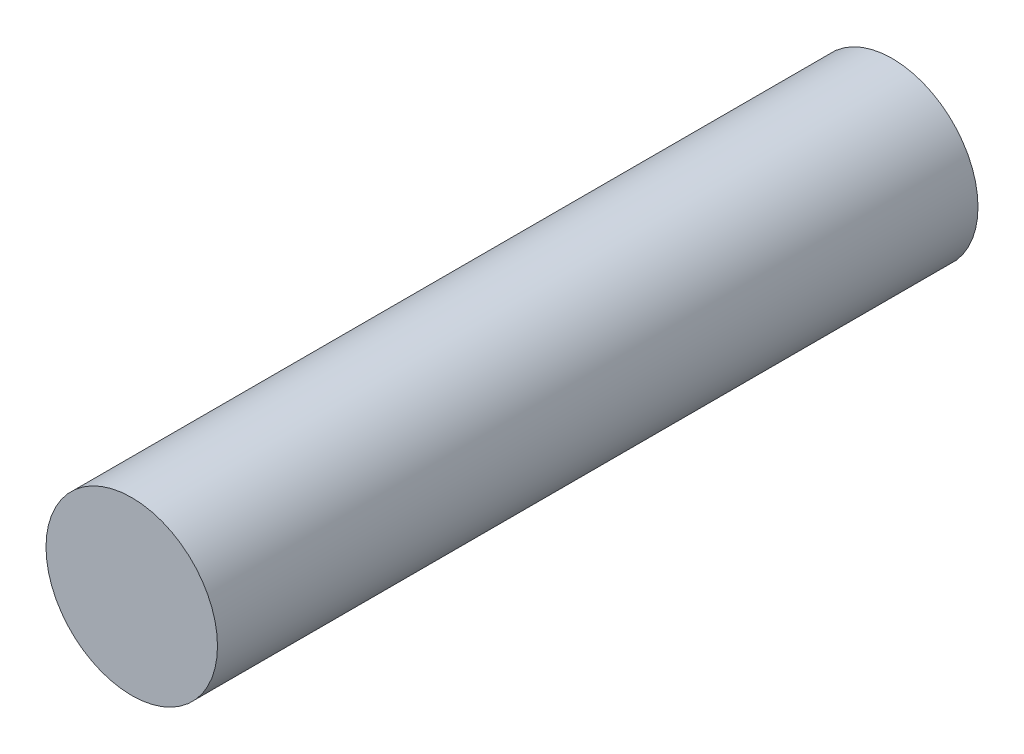
ISO-10303-21;
HEADER;
FILE_DESCRIPTION(('STEP AP214'),'2;1');
FILE_NAME('part.step','',(''),(''),'','','');
FILE_SCHEMA(('AUTOMOTIVE_DESIGN { 1 0 10303 214 1 1 1 1 }'));
ENDSEC;
DATA;
#1=APPLICATION_CONTEXT('core data for automotive mechanical design processes');
#2=APPLICATION_PROTOCOL_DEFINITION('international standard','automotive_design',2000,#1);
#3=PRODUCT_CONTEXT('',#1,'mechanical');
#4=PRODUCT('Part','Part','',(#3));
#5=PRODUCT_RELATED_PRODUCT_CATEGORY('part','',(#4));
#6=PRODUCT_DEFINITION_FORMATION('','',#4);
#7=PRODUCT_DEFINITION_CONTEXT('part definition',#1,'design');
#8=PRODUCT_DEFINITION('design','',#6,#7);
#9=PRODUCT_DEFINITION_SHAPE('','',#8);
#10=(LENGTH_UNIT() NAMED_UNIT(*) SI_UNIT(.MILLI.,.METRE.));
#11=(NAMED_UNIT(*) PLANE_ANGLE_UNIT() SI_UNIT($,.RADIAN.));
#12=(NAMED_UNIT(*) SI_UNIT($,.STERADIAN.) SOLID_ANGLE_UNIT());
#13=UNCERTAINTY_MEASURE_WITH_UNIT(LENGTH_MEASURE(1.E-05),#10,'distance_accuracy_value','');
#14=(GEOMETRIC_REPRESENTATION_CONTEXT(3) GLOBAL_UNCERTAINTY_ASSIGNED_CONTEXT((#13)) GLOBAL_UNIT_ASSIGNED_CONTEXT((#10,
#11,#12)) REPRESENTATION_CONTEXT('',''));
#15=CARTESIAN_POINT('',(0.,0.,0.));
#16=DIRECTION('',(0.,0.,1.));
#17=DIRECTION('',(1.,0.,0.));
#18=AXIS2_PLACEMENT_3D('',#15,#16,#17);
#19=CARTESIAN_POINT('',(0.,0.,-80.));
#20=DIRECTION('',(0.,0.,1.));
#21=DIRECTION('',(1.,0.,0.));
#22=AXIS2_PLACEMENT_3D('',#19,#20,#21);
#23=CYLINDRICAL_SURFACE('',#22,9.01950000000085);
#24=CARTESIAN_POINT('',(0.,0.,-80.));
#25=DIRECTION('',(0.,0.,1.));
#26=DIRECTION('',(1.,0.,0.));
#27=AXIS2_PLACEMENT_3D('',#24,#25,#26);
#28=CIRCLE('',#27,9.01950000000085);
#29=CARTESIAN_POINT('',(9.01950000000085,0.,-80.));
#30=VERTEX_POINT('',#29);
#31=EDGE_CURVE('E10',#30,#30,#28,.T.);
#32=ORIENTED_EDGE('',*,*,#31,.T.);
#33=EDGE_LOOP('',(#32));
#34=FACE_BOUND('',#33,.T.);
#35=CARTESIAN_POINT('',(0.,0.,0.));
#36=DIRECTION('',(0.,0.,1.));
#37=DIRECTION('',(1.,0.,0.));
#38=AXIS2_PLACEMENT_3D('',#35,#36,#37);
#39=CIRCLE('',#38,9.01950000000085);
#40=CARTESIAN_POINT('',(9.01950000000085,0.,0.));
#41=VERTEX_POINT('',#40);
#42=EDGE_CURVE('E33',#41,#41,#39,.T.);
#43=ORIENTED_EDGE('',*,*,#42,.F.);
#44=EDGE_LOOP('',(#43));
#45=FACE_BOUND('',#44,.T.);
#46=ADVANCED_FACE('F30',(#34,#45),#23,.T.);
#47=CARTESIAN_POINT('',(0.,0.,-80.));
#48=DIRECTION('',(0.,0.,1.));
#49=DIRECTION('',(1.,0.,0.));
#50=AXIS2_PLACEMENT_3D('',#47,#48,#49);
#51=PLANE('',#50);
#52=ORIENTED_EDGE('',*,*,#31,.F.);
#53=EDGE_LOOP('',(#52));
#54=FACE_BOUND('',#53,.T.);
#55=ADVANCED_FACE('F45',(#54),#51,.F.);
#56=CARTESIAN_POINT('',(0.,0.,0.));
#57=DIRECTION('',(0.,0.,1.));
#58=DIRECTION('',(1.,0.,0.));
#59=AXIS2_PLACEMENT_3D('',#56,#57,#58);
#60=PLANE('',#59);
#61=ORIENTED_EDGE('',*,*,#42,.T.);
#62=EDGE_LOOP('',(#61));
#63=FACE_BOUND('',#62,.T.);
#64=ADVANCED_FACE('F42',(#63),#60,.T.);
#65=CLOSED_SHELL('',(#46,#55,#64));
#66=MANIFOLD_SOLID_BREP('B2',#65);
#67=ADVANCED_BREP_SHAPE_REPRESENTATION('',(#18,#66),#14);
#68=SHAPE_DEFINITION_REPRESENTATION(#9,#67);
ENDSEC;
END-ISO-10303-21;
